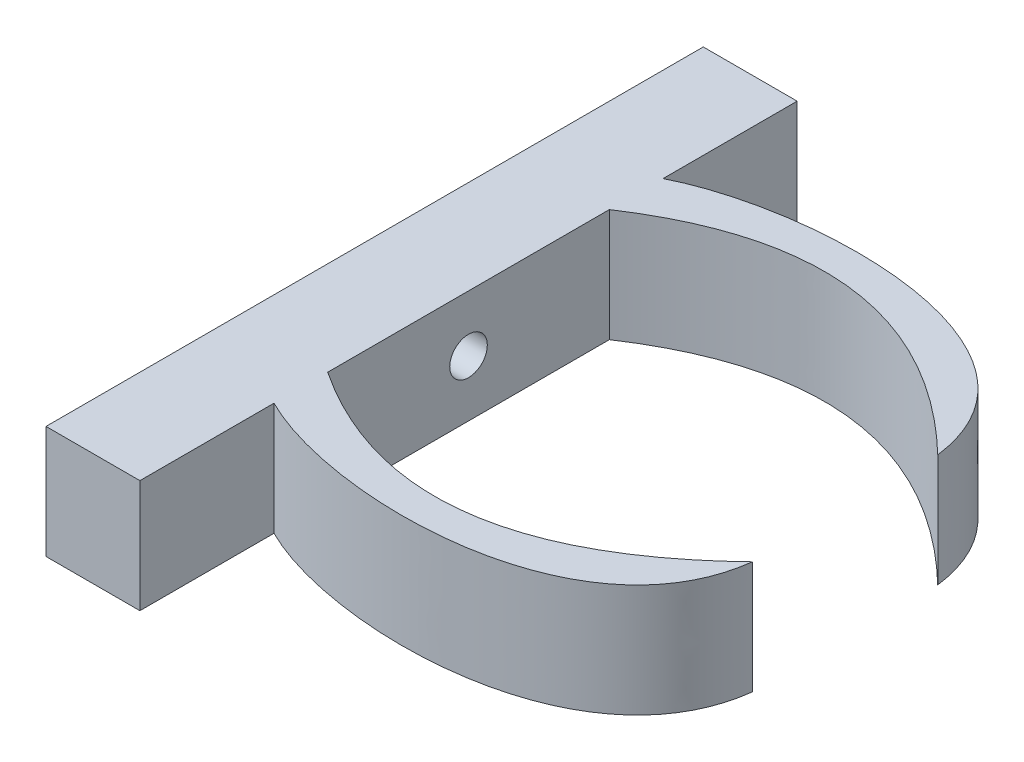
ISO-10303-21;
HEADER;
FILE_DESCRIPTION(('STEP AP214'),'2;1');
FILE_NAME('part.step','',(''),(''),'','','');
FILE_SCHEMA(('AUTOMOTIVE_DESIGN { 1 0 10303 214 1 1 1 1 }'));
ENDSEC;
DATA;
#1=APPLICATION_CONTEXT('core data for automotive mechanical design processes');
#2=APPLICATION_PROTOCOL_DEFINITION('international standard','automotive_design',2000,#1);
#3=PRODUCT_CONTEXT('',#1,'mechanical');
#4=PRODUCT('Part','Part','',(#3));
#5=PRODUCT_RELATED_PRODUCT_CATEGORY('part','',(#4));
#6=PRODUCT_DEFINITION_FORMATION('','',#4);
#7=PRODUCT_DEFINITION_CONTEXT('part definition',#1,'design');
#8=PRODUCT_DEFINITION('design','',#6,#7);
#9=PRODUCT_DEFINITION_SHAPE('','',#8);
#10=(LENGTH_UNIT() NAMED_UNIT(*) SI_UNIT(.MILLI.,.METRE.));
#11=(NAMED_UNIT(*) PLANE_ANGLE_UNIT() SI_UNIT($,.RADIAN.));
#12=(NAMED_UNIT(*) SI_UNIT($,.STERADIAN.) SOLID_ANGLE_UNIT());
#13=UNCERTAINTY_MEASURE_WITH_UNIT(LENGTH_MEASURE(1.E-05),#10,'distance_accuracy_value','');
#14=(GEOMETRIC_REPRESENTATION_CONTEXT(3) GLOBAL_UNCERTAINTY_ASSIGNED_CONTEXT((#13)) GLOBAL_UNIT_ASSIGNED_CONTEXT((#10,
#11,#12)) REPRESENTATION_CONTEXT('',''));
#15=CARTESIAN_POINT('',(0.,0.,0.));
#16=DIRECTION('',(0.,0.,1.));
#17=DIRECTION('',(1.,0.,0.));
#18=AXIS2_PLACEMENT_3D('',#15,#16,#17);
#19=CARTESIAN_POINT('',(10.,0.,0.));
#20=DIRECTION('',(1.,0.,0.));
#21=DIRECTION('',(0.,0.,-1.));
#22=AXIS2_PLACEMENT_3D('',#19,#20,#21);
#23=PLANE('',#22);
#24=DIRECTION('',(0.,0.,1.));
#25=VECTOR('',#24,1.);
#26=CARTESIAN_POINT('',(10.,6.,35.));
#27=LINE('',#26,#25);
#28=CARTESIAN_POINT('',(10.,6.,-35.));
#29=VERTEX_POINT('',#28);
#30=CARTESIAN_POINT('',(10.,6.,-20.7176368887047));
#31=VERTEX_POINT('',#30);
#32=EDGE_CURVE('E60',#29,#31,#27,.T.);
#33=ORIENTED_EDGE('',*,*,#32,.T.);
#34=DIRECTION('',(0.,1.,0.));
#35=VECTOR('',#34,1.);
#36=CARTESIAN_POINT('',(10.,-6.,-20.7176368887048));
#37=LINE('',#36,#35);
#38=CARTESIAN_POINT('',(10.,-6.,-20.7176368887047));
#39=VERTEX_POINT('',#38);
#40=EDGE_CURVE('E64',#39,#31,#37,.T.);
#41=ORIENTED_EDGE('',*,*,#40,.F.);
#42=DIRECTION('',(0.,0.,-1.));
#43=VECTOR('',#42,1.);
#44=CARTESIAN_POINT('',(10.,-6.,35.));
#45=LINE('',#44,#43);
#46=CARTESIAN_POINT('',(10.,-6.,-35.));
#47=VERTEX_POINT('',#46);
#48=EDGE_CURVE('E127',#39,#47,#45,.T.);
#49=ORIENTED_EDGE('',*,*,#48,.T.);
#50=DIRECTION('',(0.,1.,0.));
#51=VECTOR('',#50,1.);
#52=CARTESIAN_POINT('',(10.,6.,-35.));
#53=LINE('',#52,#51);
#54=EDGE_CURVE('E224',#47,#29,#53,.T.);
#55=ORIENTED_EDGE('',*,*,#54,.T.);
#56=EDGE_LOOP('',(#33,#41,#49,#55));
#57=FACE_BOUND('',#56,.T.);
#58=ADVANCED_FACE('F44',(#57),#23,.T.);
#59=CARTESIAN_POINT('',(10.,-6.,35.));
#60=VERTEX_POINT('',#59);
#61=CARTESIAN_POINT('',(10.,-6.,20.7176368887047));
#62=VERTEX_POINT('',#61);
#63=EDGE_CURVE('E234',#60,#62,#45,.T.);
#64=ORIENTED_EDGE('',*,*,#63,.T.);
#65=DIRECTION('',(0.,1.,0.));
#66=VECTOR('',#65,1.);
#67=CARTESIAN_POINT('',(10.,-6.,20.7176368887047));
#68=LINE('',#67,#66);
#69=CARTESIAN_POINT('',(10.,6.,20.7176368887047));
#70=VERTEX_POINT('',#69);
#71=EDGE_CURVE('E217',#62,#70,#68,.T.);
#72=ORIENTED_EDGE('',*,*,#71,.T.);
#73=CARTESIAN_POINT('',(10.,6.,35.));
#74=VERTEX_POINT('',#73);
#75=EDGE_CURVE('E227',#70,#74,#27,.T.);
#76=ORIENTED_EDGE('',*,*,#75,.T.);
#77=DIRECTION('',(0.,-1.,0.));
#78=VECTOR('',#77,1.);
#79=CARTESIAN_POINT('',(10.,6.,35.));
#80=LINE('',#79,#78);
#81=EDGE_CURVE('E230',#74,#60,#80,.T.);
#82=ORIENTED_EDGE('',*,*,#81,.T.);
#83=EDGE_LOOP('',(#64,#72,#76,#82));
#84=FACE_BOUND('',#83,.T.);
#85=ADVANCED_FACE('F287',(#84),#23,.T.);
#86=CARTESIAN_POINT('',(10.,6.,-35.));
#87=DIRECTION('',(0.,0.,1.));
#88=DIRECTION('',(1.,0.,0.));
#89=AXIS2_PLACEMENT_3D('',#86,#87,#88);
#90=PLANE('',#89);
#91=DIRECTION('',(0.,1.,0.));
#92=VECTOR('',#91,1.);
#93=CARTESIAN_POINT('',(0.,6.,-35.));
#94=LINE('',#93,#92);
#95=CARTESIAN_POINT('',(0.,-6.,-35.));
#96=VERTEX_POINT('',#95);
#97=CARTESIAN_POINT('',(0.,6.,-35.));
#98=VERTEX_POINT('',#97);
#99=EDGE_CURVE('E216',#96,#98,#94,.T.);
#100=ORIENTED_EDGE('',*,*,#99,.T.);
#101=DIRECTION('',(-1.,0.,0.));
#102=VECTOR('',#101,1.);
#103=CARTESIAN_POINT('',(10.,6.,-35.));
#104=LINE('',#103,#102);
#105=EDGE_CURVE('E11',#29,#98,#104,.T.);
#106=ORIENTED_EDGE('',*,*,#105,.F.);
#107=ORIENTED_EDGE('',*,*,#54,.F.);
#108=DIRECTION('',(-1.,0.,0.));
#109=VECTOR('',#108,1.);
#110=CARTESIAN_POINT('',(10.,-6.,-35.));
#111=LINE('',#110,#109);
#112=EDGE_CURVE('E238',#47,#96,#111,.T.);
#113=ORIENTED_EDGE('',*,*,#112,.T.);
#114=EDGE_LOOP('',(#100,#106,#107,#113));
#115=FACE_BOUND('',#114,.T.);
#116=ADVANCED_FACE('F46',(#115),#90,.F.);
#117=CARTESIAN_POINT('',(10.,6.,35.));
#118=DIRECTION('',(0.,-1.,0.));
#119=DIRECTION('',(0.,0.,-1.));
#120=AXIS2_PLACEMENT_3D('',#117,#118,#119);
#121=PLANE('',#120);
#122=DIRECTION('',(0.,0.,1.));
#123=VECTOR('',#122,1.);
#124=CARTESIAN_POINT('',(0.,6.,35.));
#125=LINE('',#124,#123);
#126=CARTESIAN_POINT('',(0.,6.,35.));
#127=VERTEX_POINT('',#126);
#128=EDGE_CURVE('E243',#98,#127,#125,.T.);
#129=ORIENTED_EDGE('',*,*,#128,.T.);
#130=DIRECTION('',(-1.,0.,0.));
#131=VECTOR('',#130,1.);
#132=CARTESIAN_POINT('',(10.,6.,35.));
#133=LINE('',#132,#131);
#134=EDGE_CURVE('E53',#74,#127,#133,.T.);
#135=ORIENTED_EDGE('',*,*,#134,.F.);
#136=ORIENTED_EDGE('',*,*,#75,.F.);
#137=CARTESIAN_POINT('',(10.,6.,20.7176368887047));
#138=CARTESIAN_POINT('',(21.3602708441872,6.,26.451655212481));
#139=CARTESIAN_POINT('',(47.9847082179327,6.,26.7992992170974));
#140=CARTESIAN_POINT('',(50.1056581940418,6.,9.86825597098573));
#141=B_SPLINE_CURVE_WITH_KNOTS('',3,(#137,#138,#139,#140),.UNSPECIFIED.,.F.,.F.,(4,4),(0.,1.),.UNSPECIFIED.);
#142=CARTESIAN_POINT('',(50.1056581940418,6.,9.86825597098573));
#143=VERTEX_POINT('',#142);
#144=EDGE_CURVE('E201',#70,#143,#141,.T.);
#145=ORIENTED_EDGE('',*,*,#144,.T.);
#146=CARTESIAN_POINT('',(9.99999999999999,6.,15.));
#147=CARTESIAN_POINT('',(30.6479539762187,6.,28.6689034776446));
#148=CARTESIAN_POINT('',(50.1056581940418,6.,9.86825597098573));
#149=B_SPLINE_CURVE_WITH_KNOTS('',2,(#146,#147,#148),.UNSPECIFIED.,.F.,.F.,(3,3),(0.,1.),.UNSPECIFIED.);
#150=CARTESIAN_POINT('',(10.,6.,15.));
#151=VERTEX_POINT('',#150);
#152=EDGE_CURVE('E141',#151,#143,#149,.T.);
#153=ORIENTED_EDGE('',*,*,#152,.F.);
#154=CARTESIAN_POINT('',(10.,6.,-15.));
#155=VERTEX_POINT('',#154);
#156=EDGE_CURVE('E231',#155,#151,#27,.T.);
#157=ORIENTED_EDGE('',*,*,#156,.F.);
#158=CARTESIAN_POINT('',(9.99999999999999,6.,-15.));
#159=CARTESIAN_POINT('',(30.6479539762187,6.,-28.6689034776446));
#160=CARTESIAN_POINT('',(50.1056581940418,6.,-9.86825597098573));
#161=B_SPLINE_CURVE_WITH_KNOTS('',2,(#158,#159,#160),.UNSPECIFIED.,.F.,.F.,(3,3),(0.,1.),.UNSPECIFIED.);
#162=CARTESIAN_POINT('',(50.1056581940418,6.,-9.86825597098573));
#163=VERTEX_POINT('',#162);
#164=EDGE_CURVE('E130',#155,#163,#161,.T.);
#165=ORIENTED_EDGE('',*,*,#164,.T.);
#166=CARTESIAN_POINT('',(10.,6.,-20.7176368887047));
#167=CARTESIAN_POINT('',(21.3602708441872,6.,-26.451655212481));
#168=CARTESIAN_POINT('',(47.9847082179327,6.,-26.7992992170974));
#169=CARTESIAN_POINT('',(50.1056581940418,6.,-9.86825597098573));
#170=B_SPLINE_CURVE_WITH_KNOTS('',3,(#166,#167,#168,#169),.UNSPECIFIED.,.F.,.F.,(4,4),(0.,1.),.UNSPECIFIED.);
#171=EDGE_CURVE('E136',#31,#163,#170,.T.);
#172=ORIENTED_EDGE('',*,*,#171,.F.);
#173=ORIENTED_EDGE('',*,*,#32,.F.);
#174=ORIENTED_EDGE('',*,*,#105,.T.);
#175=EDGE_LOOP('',(#129,#135,#136,#145,#153,#157,#165,#172,#173,#174));
#176=FACE_BOUND('',#175,.T.);
#177=ADVANCED_FACE('F288',(#176),#121,.F.);
#178=CARTESIAN_POINT('',(10.,6.,35.));
#179=DIRECTION('',(0.,0.,-1.));
#180=DIRECTION('',(-1.,0.,0.));
#181=AXIS2_PLACEMENT_3D('',#178,#179,#180);
#182=PLANE('',#181);
#183=DIRECTION('',(0.,-1.,0.));
#184=VECTOR('',#183,1.);
#185=CARTESIAN_POINT('',(0.,6.,35.));
#186=LINE('',#185,#184);
#187=CARTESIAN_POINT('',(0.,-6.,35.));
#188=VERTEX_POINT('',#187);
#189=EDGE_CURVE('E246',#127,#188,#186,.T.);
#190=ORIENTED_EDGE('',*,*,#189,.T.);
#191=DIRECTION('',(-1.,0.,0.));
#192=VECTOR('',#191,1.);
#193=CARTESIAN_POINT('',(10.,-6.,35.));
#194=LINE('',#193,#192);
#195=EDGE_CURVE('E254',#60,#188,#194,.T.);
#196=ORIENTED_EDGE('',*,*,#195,.F.);
#197=ORIENTED_EDGE('',*,*,#81,.F.);
#198=ORIENTED_EDGE('',*,*,#134,.T.);
#199=EDGE_LOOP('',(#190,#196,#197,#198));
#200=FACE_BOUND('',#199,.T.);
#201=ADVANCED_FACE('F264',(#200),#182,.F.);
#202=CARTESIAN_POINT('',(10.,-6.,35.));
#203=DIRECTION('',(0.,1.,0.));
#204=DIRECTION('',(0.,0.,1.));
#205=AXIS2_PLACEMENT_3D('',#202,#203,#204);
#206=PLANE('',#205);
#207=DIRECTION('',(0.,0.,-1.));
#208=VECTOR('',#207,1.);
#209=CARTESIAN_POINT('',(0.,-6.,35.));
#210=LINE('',#209,#208);
#211=EDGE_CURVE('E228',#188,#96,#210,.T.);
#212=ORIENTED_EDGE('',*,*,#211,.T.);
#213=ORIENTED_EDGE('',*,*,#112,.F.);
#214=ORIENTED_EDGE('',*,*,#48,.F.);
#215=CARTESIAN_POINT('',(10.,-6.,-20.7176368887047));
#216=CARTESIAN_POINT('',(21.3602708441872,-6.,-26.451655212481));
#217=CARTESIAN_POINT('',(47.9847082179327,-6.,-26.7992992170974));
#218=CARTESIAN_POINT('',(50.1056581940418,-6.,-9.86825597098573));
#219=B_SPLINE_CURVE_WITH_KNOTS('',3,(#215,#216,#217,#218),.UNSPECIFIED.,.F.,.F.,(4,4),(0.,1.),.UNSPECIFIED.);
#220=CARTESIAN_POINT('',(50.1056581940418,-6.,-9.86825597098573));
#221=VERTEX_POINT('',#220);
#222=EDGE_CURVE('E120',#39,#221,#219,.T.);
#223=ORIENTED_EDGE('',*,*,#222,.T.);
#224=CARTESIAN_POINT('',(9.99999999999999,-6.,-15.));
#225=CARTESIAN_POINT('',(30.6479539762187,-6.,-28.6689034776446));
#226=CARTESIAN_POINT('',(50.1056581940418,-6.,-9.86825597098573));
#227=B_SPLINE_CURVE_WITH_KNOTS('',2,(#224,#225,#226),.UNSPECIFIED.,.F.,.F.,(3,3),(0.,1.),.UNSPECIFIED.);
#228=CARTESIAN_POINT('',(10.,-6.,-15.));
#229=VERTEX_POINT('',#228);
#230=EDGE_CURVE('E125',#229,#221,#227,.T.);
#231=ORIENTED_EDGE('',*,*,#230,.F.);
#232=CARTESIAN_POINT('',(10.,-6.,15.));
#233=VERTEX_POINT('',#232);
#234=EDGE_CURVE('E239',#233,#229,#45,.T.);
#235=ORIENTED_EDGE('',*,*,#234,.F.);
#236=CARTESIAN_POINT('',(9.99999999999999,-6.,15.));
#237=CARTESIAN_POINT('',(30.6479539762187,-6.,28.6689034776446));
#238=CARTESIAN_POINT('',(50.1056581940418,-6.,9.86825597098573));
#239=B_SPLINE_CURVE_WITH_KNOTS('',2,(#236,#237,#238),.UNSPECIFIED.,.F.,.F.,(3,3),(0.,1.),.UNSPECIFIED.);
#240=CARTESIAN_POINT('',(50.1056581940418,-6.,9.86825597098573));
#241=VERTEX_POINT('',#240);
#242=EDGE_CURVE('E189',#233,#241,#239,.T.);
#243=ORIENTED_EDGE('',*,*,#242,.T.);
#244=CARTESIAN_POINT('',(10.,-6.,20.7176368887047));
#245=CARTESIAN_POINT('',(21.3602708441872,-6.,26.451655212481));
#246=CARTESIAN_POINT('',(47.9847082179327,-6.,26.7992992170974));
#247=CARTESIAN_POINT('',(50.1056581940418,-6.,9.86825597098573));
#248=B_SPLINE_CURVE_WITH_KNOTS('',3,(#244,#245,#246,#247),.UNSPECIFIED.,.F.,.F.,(4,4),(0.,1.),.UNSPECIFIED.);
#249=EDGE_CURVE('E181',#62,#241,#248,.T.);
#250=ORIENTED_EDGE('',*,*,#249,.F.);
#251=ORIENTED_EDGE('',*,*,#63,.F.);
#252=ORIENTED_EDGE('',*,*,#195,.T.);
#253=EDGE_LOOP('',(#212,#213,#214,#223,#231,#235,#243,#250,#251,#252));
#254=FACE_BOUND('',#253,.T.);
#255=ADVANCED_FACE('F122',(#254),#206,.F.);
#256=CARTESIAN_POINT('',(10.,0.,0.));
#257=DIRECTION('',(1.,0.,0.));
#258=DIRECTION('',(0.,0.,-1.));
#259=AXIS2_PLACEMENT_3D('',#256,#257,#258);
#260=CIRCLE('',#259,2.);
#261=CARTESIAN_POINT('',(10.,0.,-2.));
#262=VERTEX_POINT('',#261);
#263=EDGE_CURVE('E293',#262,#262,#260,.T.);
#264=ORIENTED_EDGE('',*,*,#263,.F.);
#265=EDGE_LOOP('',(#264));
#266=FACE_BOUND('',#265,.T.);
#267=DIRECTION('',(0.,1.,0.));
#268=VECTOR('',#267,1.);
#269=CARTESIAN_POINT('',(10.,-6.,-15.));
#270=LINE('',#269,#268);
#271=EDGE_CURVE('E142',#229,#155,#270,.T.);
#272=ORIENTED_EDGE('',*,*,#271,.T.);
#273=ORIENTED_EDGE('',*,*,#156,.T.);
#274=DIRECTION('',(0.,1.,0.));
#275=VECTOR('',#274,1.);
#276=CARTESIAN_POINT('',(10.,-6.,15.));
#277=LINE('',#276,#275);
#278=EDGE_CURVE('E188',#233,#151,#277,.T.);
#279=ORIENTED_EDGE('',*,*,#278,.F.);
#280=ORIENTED_EDGE('',*,*,#234,.T.);
#281=EDGE_LOOP('',(#272,#273,#279,#280));
#282=FACE_BOUND('',#281,.T.);
#283=ADVANCED_FACE('F281',(#266,#282),#23,.T.);
#284=CARTESIAN_POINT('',(0.,0.,0.));
#285=DIRECTION('',(1.,0.,0.));
#286=DIRECTION('',(0.,0.,-1.));
#287=AXIS2_PLACEMENT_3D('',#284,#285,#286);
#288=PLANE('',#287);
#289=CARTESIAN_POINT('',(0.,0.,0.));
#290=DIRECTION('',(-1.,0.,0.));
#291=DIRECTION('',(0.,0.,1.));
#292=AXIS2_PLACEMENT_3D('',#289,#290,#291);
#293=CIRCLE('',#292,2.);
#294=CARTESIAN_POINT('',(0.,0.,2.));
#295=VERTEX_POINT('',#294);
#296=EDGE_CURVE('E303',#295,#295,#293,.T.);
#297=ORIENTED_EDGE('',*,*,#296,.F.);
#298=EDGE_LOOP('',(#297));
#299=FACE_BOUND('',#298,.T.);
#300=ORIENTED_EDGE('',*,*,#99,.F.);
#301=ORIENTED_EDGE('',*,*,#211,.F.);
#302=ORIENTED_EDGE('',*,*,#189,.F.);
#303=ORIENTED_EDGE('',*,*,#128,.F.);
#304=EDGE_LOOP('',(#300,#301,#302,#303));
#305=FACE_BOUND('',#304,.T.);
#306=ADVANCED_FACE('F271',(#299,#305),#288,.F.);
#307=DIRECTION('',(0.,1.,0.));
#308=VECTOR('',#307,1.);
#309=SURFACE_OF_LINEAR_EXTRUSION('',#239,#308);
#310=ORIENTED_EDGE('',*,*,#152,.T.);
#311=DIRECTION('',(0.,1.,0.));
#312=VECTOR('',#311,1.);
#313=CARTESIAN_POINT('',(50.1056581940418,-6.,9.86825597098573));
#314=LINE('',#313,#312);
#315=EDGE_CURVE('E210',#241,#143,#314,.T.);
#316=ORIENTED_EDGE('',*,*,#315,.F.);
#317=ORIENTED_EDGE('',*,*,#242,.F.);
#318=ORIENTED_EDGE('',*,*,#278,.T.);
#319=EDGE_LOOP('',(#310,#316,#317,#318));
#320=FACE_BOUND('',#319,.T.);
#321=ADVANCED_FACE('F177',(#320),#309,.F.);
#322=DIRECTION('',(0.,1.,0.));
#323=VECTOR('',#322,1.);
#324=SURFACE_OF_LINEAR_EXTRUSION('',#248,#323);
#325=ORIENTED_EDGE('',*,*,#144,.F.);
#326=ORIENTED_EDGE('',*,*,#71,.F.);
#327=ORIENTED_EDGE('',*,*,#249,.T.);
#328=ORIENTED_EDGE('',*,*,#315,.T.);
#329=EDGE_LOOP('',(#325,#326,#327,#328));
#330=FACE_BOUND('',#329,.T.);
#331=ADVANCED_FACE('F173',(#330),#324,.T.);
#332=DIRECTION('',(0.,1.,0.));
#333=VECTOR('',#332,1.);
#334=SURFACE_OF_LINEAR_EXTRUSION('',#219,#333);
#335=ORIENTED_EDGE('',*,*,#171,.T.);
#336=DIRECTION('',(0.,1.,0.));
#337=VECTOR('',#336,1.);
#338=CARTESIAN_POINT('',(50.1056581940418,-6.,-9.86825597098573));
#339=LINE('',#338,#337);
#340=EDGE_CURVE('E133',#221,#163,#339,.T.);
#341=ORIENTED_EDGE('',*,*,#340,.F.);
#342=ORIENTED_EDGE('',*,*,#222,.F.);
#343=ORIENTED_EDGE('',*,*,#40,.T.);
#344=EDGE_LOOP('',(#335,#341,#342,#343));
#345=FACE_BOUND('',#344,.T.);
#346=ADVANCED_FACE('F134',(#345),#334,.F.);
#347=DIRECTION('',(0.,1.,0.));
#348=VECTOR('',#347,1.);
#349=SURFACE_OF_LINEAR_EXTRUSION('',#227,#348);
#350=ORIENTED_EDGE('',*,*,#164,.F.);
#351=ORIENTED_EDGE('',*,*,#271,.F.);
#352=ORIENTED_EDGE('',*,*,#230,.T.);
#353=ORIENTED_EDGE('',*,*,#340,.T.);
#354=EDGE_LOOP('',(#350,#351,#352,#353));
#355=FACE_BOUND('',#354,.T.);
#356=ADVANCED_FACE('F145',(#355),#349,.T.);
#357=CARTESIAN_POINT('',(12.,0.,0.));
#358=DIRECTION('',(-1.,0.,0.));
#359=DIRECTION('',(0.,0.,1.));
#360=AXIS2_PLACEMENT_3D('',#357,#358,#359);
#361=CYLINDRICAL_SURFACE('',#360,2.);
#362=ORIENTED_EDGE('',*,*,#263,.T.);
#363=EDGE_LOOP('',(#362));
#364=FACE_BOUND('',#363,.T.);
#365=ORIENTED_EDGE('',*,*,#296,.T.);
#366=EDGE_LOOP('',(#365));
#367=FACE_BOUND('',#366,.T.);
#368=ADVANCED_FACE('F170',(#364,#367),#361,.F.);
#369=CLOSED_SHELL('',(#58,#85,#116,#177,#201,#255,#283,#306,#321,#331,#346,#356,#368));
#370=MANIFOLD_SOLID_BREP('B2',#369);
#371=ADVANCED_BREP_SHAPE_REPRESENTATION('',(#18,#370),#14);
#372=SHAPE_DEFINITION_REPRESENTATION(#9,#371);
ENDSEC;
END-ISO-10303-21;
